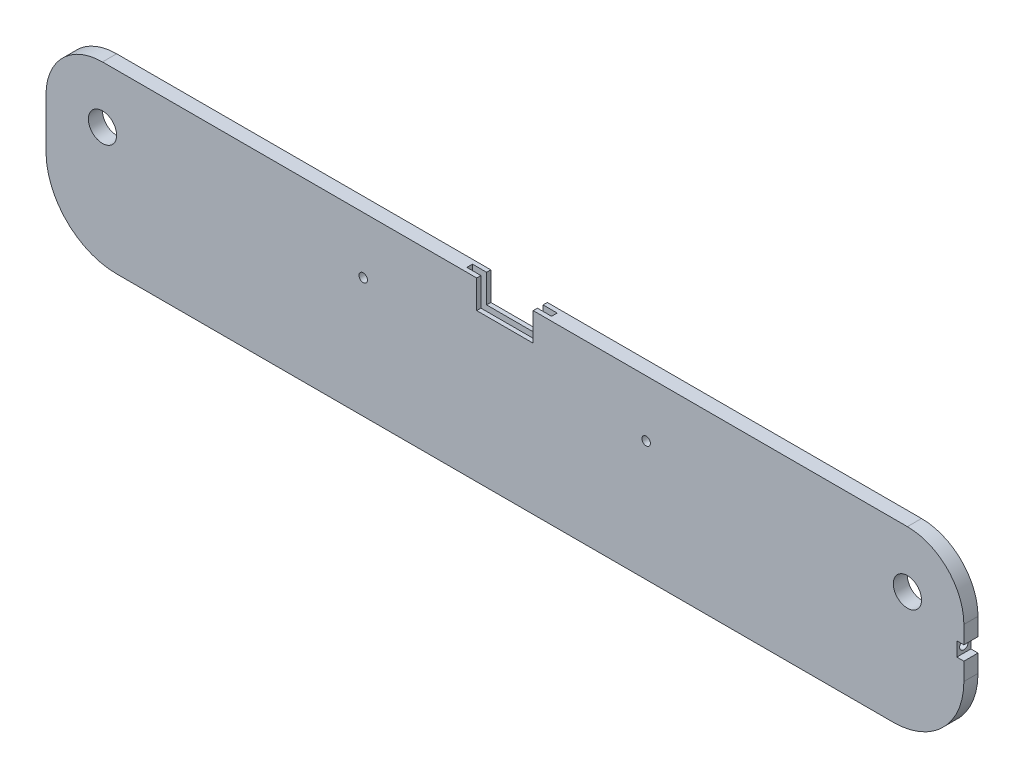
ISO-10303-21;
HEADER;
FILE_DESCRIPTION(('STEP AP214'),'2;1');
FILE_NAME('part.step','',(''),(''),'','','');
FILE_SCHEMA(('AUTOMOTIVE_DESIGN { 1 0 10303 214 1 1 1 1 }'));
ENDSEC;
DATA;
#1=APPLICATION_CONTEXT('core data for automotive mechanical design processes');
#2=APPLICATION_PROTOCOL_DEFINITION('international standard','automotive_design',2000,#1);
#3=PRODUCT_CONTEXT('',#1,'mechanical');
#4=PRODUCT('Part','Part','',(#3));
#5=PRODUCT_RELATED_PRODUCT_CATEGORY('part','',(#4));
#6=PRODUCT_DEFINITION_FORMATION('','',#4);
#7=PRODUCT_DEFINITION_CONTEXT('part definition',#1,'design');
#8=PRODUCT_DEFINITION('design','',#6,#7);
#9=PRODUCT_DEFINITION_SHAPE('','',#8);
#10=(LENGTH_UNIT() NAMED_UNIT(*) SI_UNIT(.MILLI.,.METRE.));
#11=(NAMED_UNIT(*) PLANE_ANGLE_UNIT() SI_UNIT($,.RADIAN.));
#12=(NAMED_UNIT(*) SI_UNIT($,.STERADIAN.) SOLID_ANGLE_UNIT());
#13=UNCERTAINTY_MEASURE_WITH_UNIT(LENGTH_MEASURE(1.E-05),#10,'distance_accuracy_value','');
#14=(GEOMETRIC_REPRESENTATION_CONTEXT(3) GLOBAL_UNCERTAINTY_ASSIGNED_CONTEXT((#13)) GLOBAL_UNIT_ASSIGNED_CONTEXT((#10,
#11,#12)) REPRESENTATION_CONTEXT('',''));
#15=CARTESIAN_POINT('',(0.,0.,0.));
#16=DIRECTION('',(0.,0.,1.));
#17=DIRECTION('',(1.,0.,0.));
#18=AXIS2_PLACEMENT_3D('',#15,#16,#17);
#19=CARTESIAN_POINT('',(602.895928309746,88.3096819482084,10.));
#20=DIRECTION('',(-1.,0.,0.));
#21=DIRECTION('',(0.,0.,1.));
#22=AXIS2_PLACEMENT_3D('',#19,#20,#21);
#23=PLANE('',#22);
#24=DIRECTION('',(0.,1.,0.));
#25=VECTOR('',#24,1.);
#26=CARTESIAN_POINT('',(602.895928309746,88.3096819482084,0.));
#27=LINE('',#26,#25);
#28=CARTESIAN_POINT('',(602.895928309746,35.8096819482084,0.));
#29=VERTEX_POINT('',#28);
#30=CARTESIAN_POINT('',(602.895928309746,48.3096819482084,0.));
#31=VERTEX_POINT('',#30);
#32=EDGE_CURVE('E344',#29,#31,#27,.T.);
#33=ORIENTED_EDGE('',*,*,#32,.T.);
#34=DIRECTION('',(0.,0.,-1.));
#35=VECTOR('',#34,1.);
#36=CARTESIAN_POINT('',(602.895928309746,48.3096819482084,10.));
#37=LINE('',#36,#35);
#38=CARTESIAN_POINT('',(602.895928309746,48.3096819482084,10.));
#39=VERTEX_POINT('',#38);
#40=EDGE_CURVE('E377',#31,#39,#37,.F.);
#41=ORIENTED_EDGE('',*,*,#40,.T.);
#42=DIRECTION('',(0.,1.,0.));
#43=VECTOR('',#42,1.);
#44=CARTESIAN_POINT('',(602.895928309746,88.3096819482084,10.));
#45=LINE('',#44,#43);
#46=CARTESIAN_POINT('',(602.895928309746,35.8096819482084,10.));
#47=VERTEX_POINT('',#46);
#48=EDGE_CURVE('E335',#47,#39,#45,.T.);
#49=ORIENTED_EDGE('',*,*,#48,.F.);
#50=DIRECTION('',(0.,0.,1.));
#51=VECTOR('',#50,1.);
#52=CARTESIAN_POINT('',(602.895928309746,35.8096819482084,10.));
#53=LINE('',#52,#51);
#54=EDGE_CURVE('E221',#29,#47,#53,.T.);
#55=ORIENTED_EDGE('',*,*,#54,.F.);
#56=EDGE_LOOP('',(#33,#41,#49,#55));
#57=FACE_BOUND('',#56,.T.);
#58=ADVANCED_FACE('F39',(#57),#23,.F.);
#59=CARTESIAN_POINT('',(-47.104071690254,88.3096819482084,10.));
#60=DIRECTION('',(0.,-1.,0.));
#61=DIRECTION('',(0.,0.,-1.));
#62=AXIS2_PLACEMENT_3D('',#59,#60,#61);
#63=PLANE('',#62);
#64=DIRECTION('',(-1.,0.,0.));
#65=VECTOR('',#64,1.);
#66=CARTESIAN_POINT('',(-47.104071690254,88.3096819482084,0.));
#67=LINE('',#66,#65);
#68=CARTESIAN_POINT('',(257.895928309746,88.3096819482084,0.));
#69=VERTEX_POINT('',#68);
#70=CARTESIAN_POINT('',(-7.10407169025395,88.3096819482084,0.));
#71=VERTEX_POINT('',#70);
#72=EDGE_CURVE('E347',#69,#71,#67,.T.);
#73=ORIENTED_EDGE('',*,*,#72,.T.);
#74=DIRECTION('',(0.,0.,-1.));
#75=VECTOR('',#74,1.);
#76=CARTESIAN_POINT('',(-7.10407169025395,88.3096819482084,10.));
#77=LINE('',#76,#75);
#78=CARTESIAN_POINT('',(-7.10407169025395,88.3096819482084,10.));
#79=VERTEX_POINT('',#78);
#80=EDGE_CURVE('E47',#71,#79,#77,.F.);
#81=ORIENTED_EDGE('',*,*,#80,.T.);
#82=DIRECTION('',(-1.,0.,0.));
#83=VECTOR('',#82,1.);
#84=CARTESIAN_POINT('',(-47.104071690254,88.3096819482084,10.));
#85=LINE('',#84,#83);
#86=CARTESIAN_POINT('',(257.895928309746,88.3096819482084,10.));
#87=VERTEX_POINT('',#86);
#88=EDGE_CURVE('E337',#87,#79,#85,.T.);
#89=ORIENTED_EDGE('',*,*,#88,.F.);
#90=DIRECTION('',(0.,0.,1.));
#91=VECTOR('',#90,1.);
#92=CARTESIAN_POINT('',(257.895928309746,88.3096819482084,-20.));
#93=LINE('',#92,#91);
#94=CARTESIAN_POINT('',(257.895928309746,88.3096819482084,7.));
#95=VERTEX_POINT('',#94);
#96=EDGE_CURVE('E248',#95,#87,#93,.T.);
#97=ORIENTED_EDGE('',*,*,#96,.F.);
#98=DIRECTION('',(1.,0.,0.));
#99=VECTOR('',#98,1.);
#100=CARTESIAN_POINT('',(307.895928309746,88.3096819482084,7.));
#101=LINE('',#100,#99);
#102=CARTESIAN_POINT('',(247.895928309746,88.3096819482084,7.));
#103=VERTEX_POINT('',#102);
#104=EDGE_CURVE('E291',#103,#95,#101,.T.);
#105=ORIENTED_EDGE('',*,*,#104,.F.);
#106=DIRECTION('',(0.,0.,1.));
#107=VECTOR('',#106,1.);
#108=CARTESIAN_POINT('',(247.895928309746,88.3096819482084,7.));
#109=LINE('',#108,#107);
#110=CARTESIAN_POINT('',(247.895928309746,88.3096819482084,3.));
#111=VERTEX_POINT('',#110);
#112=EDGE_CURVE('E274',#111,#103,#109,.T.);
#113=ORIENTED_EDGE('',*,*,#112,.F.);
#114=DIRECTION('',(-1.,0.,0.));
#115=VECTOR('',#114,1.);
#116=CARTESIAN_POINT('',(277.895928309746,88.3096819482084,3.));
#117=LINE('',#116,#115);
#118=CARTESIAN_POINT('',(257.895928309746,88.3096819482084,3.));
#119=VERTEX_POINT('',#118);
#120=EDGE_CURVE('E297',#119,#111,#117,.T.);
#121=ORIENTED_EDGE('',*,*,#120,.F.);
#122=EDGE_CURVE('E247',#69,#119,#93,.T.);
#123=ORIENTED_EDGE('',*,*,#122,.F.);
#124=EDGE_LOOP('',(#73,#81,#89,#97,#105,#113,#121,#123));
#125=FACE_BOUND('',#124,.T.);
#126=ADVANCED_FACE('F419',(#125),#63,.F.);
#127=CARTESIAN_POINT('',(-47.104071690254,88.3096819482084,10.));
#128=DIRECTION('',(1.,0.,0.));
#129=DIRECTION('',(0.,1.,0.));
#130=AXIS2_PLACEMENT_3D('',#127,#128,#129);
#131=PLANE('',#130);
#132=DIRECTION('',(0.,-1.,0.));
#133=VECTOR('',#132,1.);
#134=CARTESIAN_POINT('',(-47.104071690254,88.3096819482084,10.));
#135=LINE('',#134,#133);
#136=CARTESIAN_POINT('',(-47.1040716902539,48.3096819482084,10.));
#137=VERTEX_POINT('',#136);
#138=CARTESIAN_POINT('',(-47.1040716902539,13.3096819482084,10.));
#139=VERTEX_POINT('',#138);
#140=EDGE_CURVE('E330',#137,#139,#135,.T.);
#141=ORIENTED_EDGE('',*,*,#140,.F.);
#142=DIRECTION('',(0.,0.,-1.));
#143=VECTOR('',#142,1.);
#144=CARTESIAN_POINT('',(-47.1040716902539,48.3096819482084,10.));
#145=LINE('',#144,#143);
#146=CARTESIAN_POINT('',(-47.1040716902539,48.3096819482084,0.));
#147=VERTEX_POINT('',#146);
#148=EDGE_CURVE('E393',#137,#147,#145,.T.);
#149=ORIENTED_EDGE('',*,*,#148,.T.);
#150=DIRECTION('',(0.,-1.,0.));
#151=VECTOR('',#150,1.);
#152=CARTESIAN_POINT('',(-47.104071690254,88.3096819482084,0.));
#153=LINE('',#152,#151);
#154=CARTESIAN_POINT('',(-47.1040716902539,13.3096819482084,0.));
#155=VERTEX_POINT('',#154);
#156=EDGE_CURVE('E327',#147,#155,#153,.T.);
#157=ORIENTED_EDGE('',*,*,#156,.T.);
#158=DIRECTION('',(0.,0.,-1.));
#159=VECTOR('',#158,1.);
#160=CARTESIAN_POINT('',(-47.1040716902539,13.3096819482084,10.));
#161=LINE('',#160,#159);
#162=EDGE_CURVE('E387',#155,#139,#161,.F.);
#163=ORIENTED_EDGE('',*,*,#162,.T.);
#164=EDGE_LOOP('',(#141,#149,#157,#163));
#165=FACE_BOUND('',#164,.T.);
#166=ADVANCED_FACE('F399',(#165),#131,.F.);
#167=CARTESIAN_POINT('',(-47.1040716902539,-36.6903180517916,10.));
#168=DIRECTION('',(0.,1.,0.));
#169=DIRECTION('',(0.,0.,1.));
#170=AXIS2_PLACEMENT_3D('',#167,#168,#169);
#171=PLANE('',#170);
#172=DIRECTION('',(0.,0.,-1.));
#173=VECTOR('',#172,1.);
#174=CARTESIAN_POINT('',(552.895928309746,-36.6903180517916,10.));
#175=LINE('',#174,#173);
#176=CARTESIAN_POINT('',(552.895928309746,-36.6903180517916,0.));
#177=VERTEX_POINT('',#176);
#178=CARTESIAN_POINT('',(552.895928309746,-36.6903180517916,10.));
#179=VERTEX_POINT('',#178);
#180=EDGE_CURVE('E367',#177,#179,#175,.F.);
#181=ORIENTED_EDGE('',*,*,#180,.T.);
#182=DIRECTION('',(1.,0.,0.));
#183=VECTOR('',#182,1.);
#184=CARTESIAN_POINT('',(-47.1040716902539,-36.6903180517916,10.));
#185=LINE('',#184,#183);
#186=CARTESIAN_POINT('',(2.89592830974606,-36.6903180517916,10.));
#187=VERTEX_POINT('',#186);
#188=EDGE_CURVE('E332',#187,#179,#185,.T.);
#189=ORIENTED_EDGE('',*,*,#188,.F.);
#190=DIRECTION('',(0.,0.,-1.));
#191=VECTOR('',#190,1.);
#192=CARTESIAN_POINT('',(2.89592830974606,-36.6903180517916,10.));
#193=LINE('',#192,#191);
#194=CARTESIAN_POINT('',(2.89592830974606,-36.6903180517916,0.));
#195=VERTEX_POINT('',#194);
#196=EDGE_CURVE('E381',#187,#195,#193,.T.);
#197=ORIENTED_EDGE('',*,*,#196,.T.);
#198=DIRECTION('',(1.,0.,0.));
#199=VECTOR('',#198,1.);
#200=CARTESIAN_POINT('',(-47.1040716902539,-36.6903180517916,0.));
#201=LINE('',#200,#199);
#202=EDGE_CURVE('E342',#195,#177,#201,.T.);
#203=ORIENTED_EDGE('',*,*,#202,.T.);
#204=EDGE_LOOP('',(#181,#189,#197,#203));
#205=FACE_BOUND('',#204,.T.);
#206=ADVANCED_FACE('F433',(#205),#171,.F.);
#207=CARTESIAN_POINT('',(602.895928309746,13.3096819482084,10.));
#208=VERTEX_POINT('',#207);
#209=CARTESIAN_POINT('',(602.895928309746,25.8096819482084,10.));
#210=VERTEX_POINT('',#209);
#211=EDGE_CURVE('E226',#208,#210,#45,.T.);
#212=ORIENTED_EDGE('',*,*,#211,.F.);
#213=DIRECTION('',(0.,0.,-1.));
#214=VECTOR('',#213,1.);
#215=CARTESIAN_POINT('',(602.895928309746,13.3096819482084,10.));
#216=LINE('',#215,#214);
#217=CARTESIAN_POINT('',(602.895928309746,13.3096819482084,0.));
#218=VERTEX_POINT('',#217);
#219=EDGE_CURVE('E361',#208,#218,#216,.T.);
#220=ORIENTED_EDGE('',*,*,#219,.T.);
#221=CARTESIAN_POINT('',(602.895928309746,25.8096819482084,0.));
#222=VERTEX_POINT('',#221);
#223=EDGE_CURVE('E345',#218,#222,#27,.T.);
#224=ORIENTED_EDGE('',*,*,#223,.T.);
#225=DIRECTION('',(0.,0.,-1.));
#226=VECTOR('',#225,1.);
#227=CARTESIAN_POINT('',(602.895928309746,25.8096819482084,10.));
#228=LINE('',#227,#226);
#229=EDGE_CURVE('E442',#210,#222,#228,.T.);
#230=ORIENTED_EDGE('',*,*,#229,.F.);
#231=EDGE_LOOP('',(#212,#220,#224,#230));
#232=FACE_BOUND('',#231,.T.);
#233=ADVANCED_FACE('F422',(#232),#23,.F.);
#234=CARTESIAN_POINT('',(562.895928309746,88.3096819482084,10.));
#235=VERTEX_POINT('',#234);
#236=CARTESIAN_POINT('',(297.895928309746,88.3096819482084,10.));
#237=VERTEX_POINT('',#236);
#238=EDGE_CURVE('E338',#235,#237,#85,.T.);
#239=ORIENTED_EDGE('',*,*,#238,.F.);
#240=DIRECTION('',(0.,0.,-1.));
#241=VECTOR('',#240,1.);
#242=CARTESIAN_POINT('',(562.895928309746,88.3096819482084,10.));
#243=LINE('',#242,#241);
#244=CARTESIAN_POINT('',(562.895928309746,88.3096819482084,0.));
#245=VERTEX_POINT('',#244);
#246=EDGE_CURVE('E372',#235,#245,#243,.T.);
#247=ORIENTED_EDGE('',*,*,#246,.T.);
#248=CARTESIAN_POINT('',(297.895928309746,88.3096819482084,0.));
#249=VERTEX_POINT('',#248);
#250=EDGE_CURVE('E333',#245,#249,#67,.T.);
#251=ORIENTED_EDGE('',*,*,#250,.T.);
#252=DIRECTION('',(0.,0.,1.));
#253=VECTOR('',#252,1.);
#254=CARTESIAN_POINT('',(297.895928309746,88.3096819482084,-20.));
#255=LINE('',#254,#253);
#256=CARTESIAN_POINT('',(297.895928309746,88.3096819482084,3.));
#257=VERTEX_POINT('',#256);
#258=EDGE_CURVE('E250',#249,#257,#255,.T.);
#259=ORIENTED_EDGE('',*,*,#258,.T.);
#260=CARTESIAN_POINT('',(307.895928309746,88.3096819482084,3.));
#261=VERTEX_POINT('',#260);
#262=EDGE_CURVE('E279',#261,#257,#117,.T.);
#263=ORIENTED_EDGE('',*,*,#262,.F.);
#264=DIRECTION('',(0.,0.,-1.));
#265=VECTOR('',#264,1.);
#266=CARTESIAN_POINT('',(307.895928309746,88.3096819482084,3.));
#267=LINE('',#266,#265);
#268=CARTESIAN_POINT('',(307.895928309746,88.3096819482084,7.));
#269=VERTEX_POINT('',#268);
#270=EDGE_CURVE('E294',#269,#261,#267,.T.);
#271=ORIENTED_EDGE('',*,*,#270,.F.);
#272=CARTESIAN_POINT('',(297.895928309746,88.3096819482084,7.));
#273=VERTEX_POINT('',#272);
#274=EDGE_CURVE('E290',#273,#269,#101,.T.);
#275=ORIENTED_EDGE('',*,*,#274,.F.);
#276=EDGE_CURVE('E251',#273,#237,#255,.T.);
#277=ORIENTED_EDGE('',*,*,#276,.T.);
#278=EDGE_LOOP('',(#239,#247,#251,#259,#263,#271,#275,#277));
#279=FACE_BOUND('',#278,.T.);
#280=ADVANCED_FACE('F429',(#279),#63,.F.);
#281=CARTESIAN_POINT('',(0.,0.,10.));
#282=DIRECTION('',(0.,0.,1.));
#283=DIRECTION('',(1.,0.,0.));
#284=AXIS2_PLACEMENT_3D('',#281,#282,#283);
#285=PLANE('',#284);
#286=ORIENTED_EDGE('',*,*,#188,.T.);
#287=CARTESIAN_POINT('',(552.895928309746,13.3096819482084,10.));
#288=DIRECTION('',(0.,0.,1.));
#289=DIRECTION('',(1.,0.,0.));
#290=AXIS2_PLACEMENT_3D('',#287,#288,#289);
#291=CIRCLE('',#290,50.);
#292=EDGE_CURVE('E370',#179,#208,#291,.T.);
#293=ORIENTED_EDGE('',*,*,#292,.T.);
#294=ORIENTED_EDGE('',*,*,#211,.T.);
#295=DIRECTION('',(1.,0.,0.));
#296=VECTOR('',#295,1.);
#297=CARTESIAN_POINT('',(597.895928309746,25.8096819482084,10.));
#298=LINE('',#297,#296);
#299=CARTESIAN_POINT('',(597.895928309746,25.8096819482084,10.));
#300=VERTEX_POINT('',#299);
#301=EDGE_CURVE('E205',#300,#210,#298,.T.);
#302=ORIENTED_EDGE('',*,*,#301,.F.);
#303=DIRECTION('',(0.,-1.,0.));
#304=VECTOR('',#303,1.);
#305=CARTESIAN_POINT('',(597.895928309746,25.8096819482084,10.));
#306=LINE('',#305,#304);
#307=CARTESIAN_POINT('',(597.895928309746,35.8096819482084,10.));
#308=VERTEX_POINT('',#307);
#309=EDGE_CURVE('E212',#308,#300,#306,.T.);
#310=ORIENTED_EDGE('',*,*,#309,.F.);
#311=DIRECTION('',(1.,0.,0.));
#312=VECTOR('',#311,1.);
#313=CARTESIAN_POINT('',(597.895928309746,35.8096819482084,10.));
#314=LINE('',#313,#312);
#315=EDGE_CURVE('E237',#308,#47,#314,.T.);
#316=ORIENTED_EDGE('',*,*,#315,.T.);
#317=ORIENTED_EDGE('',*,*,#48,.T.);
#318=CARTESIAN_POINT('',(562.895928309746,48.3096819482084,10.));
#319=DIRECTION('',(0.,0.,1.));
#320=DIRECTION('',(1.,0.,0.));
#321=AXIS2_PLACEMENT_3D('',#318,#319,#320);
#322=CIRCLE('',#321,40.);
#323=EDGE_CURVE('E379',#39,#235,#322,.T.);
#324=ORIENTED_EDGE('',*,*,#323,.T.);
#325=ORIENTED_EDGE('',*,*,#238,.T.);
#326=DIRECTION('',(0.,1.,0.));
#327=VECTOR('',#326,1.);
#328=CARTESIAN_POINT('',(297.895928309746,88.3096819482084,10.));
#329=LINE('',#328,#327);
#330=CARTESIAN_POINT('',(297.895928309746,68.3096819482085,10.));
#331=VERTEX_POINT('',#330);
#332=EDGE_CURVE('E233',#331,#237,#329,.T.);
#333=ORIENTED_EDGE('',*,*,#332,.F.);
#334=DIRECTION('',(1.,0.,0.));
#335=VECTOR('',#334,1.);
#336=CARTESIAN_POINT('',(277.895928309746,68.3096819482085,10.));
#337=LINE('',#336,#335);
#338=CARTESIAN_POINT('',(257.895928309746,68.3096819482084,10.));
#339=VERTEX_POINT('',#338);
#340=EDGE_CURVE('E240',#339,#331,#337,.T.);
#341=ORIENTED_EDGE('',*,*,#340,.F.);
#342=DIRECTION('',(0.,-1.,0.));
#343=VECTOR('',#342,1.);
#344=CARTESIAN_POINT('',(257.895928309746,68.3096819482084,10.));
#345=LINE('',#344,#343);
#346=EDGE_CURVE('E236',#87,#339,#345,.T.);
#347=ORIENTED_EDGE('',*,*,#346,.F.);
#348=ORIENTED_EDGE('',*,*,#88,.T.);
#349=CARTESIAN_POINT('',(-7.10407169025395,48.3096819482084,10.));
#350=DIRECTION('',(0.,0.,1.));
#351=DIRECTION('',(1.,0.,0.));
#352=AXIS2_PLACEMENT_3D('',#349,#350,#351);
#353=CIRCLE('',#352,40.);
#354=EDGE_CURVE('E11',#79,#137,#353,.T.);
#355=ORIENTED_EDGE('',*,*,#354,.T.);
#356=ORIENTED_EDGE('',*,*,#140,.T.);
#357=CARTESIAN_POINT('',(2.89592830974606,13.3096819482084,10.));
#358=DIRECTION('',(0.,0.,1.));
#359=DIRECTION('',(1.,0.,0.));
#360=AXIS2_PLACEMENT_3D('',#357,#358,#359);
#361=CIRCLE('',#360,50.);
#362=EDGE_CURVE('E390',#139,#187,#361,.T.);
#363=ORIENTED_EDGE('',*,*,#362,.T.);
#364=EDGE_LOOP('',(#286,#293,#294,#302,#310,#316,#317,#324,#325,#333,#341,#347,#348,#355,#356,#363));
#365=FACE_BOUND('',#364,.T.);
#366=CARTESIAN_POINT('',(177.509070800599,48.3096819482085,10.));
#367=DIRECTION('',(0.,0.,1.));
#368=DIRECTION('',(1.,0.,0.));
#369=AXIS2_PLACEMENT_3D('',#366,#367,#368);
#370=CIRCLE('',#369,2.99999999999999);
#371=CARTESIAN_POINT('',(180.509070800599,48.3096819482085,10.));
#372=VERTEX_POINT('',#371);
#373=EDGE_CURVE('E310',#372,#372,#370,.T.);
#374=ORIENTED_EDGE('',*,*,#373,.F.);
#375=EDGE_LOOP('',(#374));
#376=FACE_BOUND('',#375,.T.);
#377=CARTESIAN_POINT('',(377.895928309746,48.3096819482086,10.));
#378=DIRECTION('',(0.,0.,1.));
#379=DIRECTION('',(1.,0.,0.));
#380=AXIS2_PLACEMENT_3D('',#377,#378,#379);
#381=CIRCLE('',#380,2.99999999999999);
#382=CARTESIAN_POINT('',(380.895928309746,48.3096819482086,10.));
#383=VERTEX_POINT('',#382);
#384=EDGE_CURVE('E302',#383,#383,#381,.T.);
#385=ORIENTED_EDGE('',*,*,#384,.F.);
#386=EDGE_LOOP('',(#385));
#387=FACE_BOUND('',#386,.T.);
#388=CARTESIAN_POINT('',(562.895928309746,48.3096819482086,10.));
#389=DIRECTION('',(0.,0.,1.));
#390=DIRECTION('',(-1.,0.,0.));
#391=AXIS2_PLACEMENT_3D('',#388,#389,#390);
#392=CIRCLE('',#391,9.99999999999998);
#393=CARTESIAN_POINT('',(552.895928309746,48.3096819482086,10.));
#394=VERTEX_POINT('',#393);
#395=EDGE_CURVE('E320',#394,#394,#392,.T.);
#396=ORIENTED_EDGE('',*,*,#395,.F.);
#397=EDGE_LOOP('',(#396));
#398=FACE_BOUND('',#397,.T.);
#399=CARTESIAN_POINT('',(-7.10407169025393,48.3096819482084,10.));
#400=DIRECTION('',(0.,0.,1.));
#401=DIRECTION('',(1.,0.,0.));
#402=AXIS2_PLACEMENT_3D('',#399,#400,#401);
#403=CIRCLE('',#402,10.);
#404=CARTESIAN_POINT('',(2.89592830974607,48.3096819482084,10.));
#405=VERTEX_POINT('',#404);
#406=EDGE_CURVE('E319',#405,#405,#403,.T.);
#407=ORIENTED_EDGE('',*,*,#406,.F.);
#408=EDGE_LOOP('',(#407));
#409=FACE_BOUND('',#408,.T.);
#410=ADVANCED_FACE('F223',(#365,#376,#387,#398,#409),#285,.T.);
#411=CARTESIAN_POINT('',(0.,0.,0.));
#412=DIRECTION('',(0.,0.,1.));
#413=DIRECTION('',(1.,0.,0.));
#414=AXIS2_PLACEMENT_3D('',#411,#412,#413);
#415=PLANE('',#414);
#416=ORIENTED_EDGE('',*,*,#156,.F.);
#417=CARTESIAN_POINT('',(-7.10407169025395,48.3096819482084,0.));
#418=DIRECTION('',(0.,0.,1.));
#419=DIRECTION('',(1.,0.,0.));
#420=AXIS2_PLACEMENT_3D('',#417,#418,#419);
#421=CIRCLE('',#420,40.);
#422=EDGE_CURVE('E61',#147,#71,#421,.F.);
#423=ORIENTED_EDGE('',*,*,#422,.T.);
#424=ORIENTED_EDGE('',*,*,#72,.F.);
#425=DIRECTION('',(0.,-1.,0.));
#426=VECTOR('',#425,1.);
#427=CARTESIAN_POINT('',(257.895928309746,0.,0.));
#428=LINE('',#427,#426);
#429=CARTESIAN_POINT('',(257.895928309746,68.3096819482084,0.));
#430=VERTEX_POINT('',#429);
#431=EDGE_CURVE('E265',#69,#430,#428,.T.);
#432=ORIENTED_EDGE('',*,*,#431,.T.);
#433=DIRECTION('',(1.,0.,0.));
#434=VECTOR('',#433,1.);
#435=CARTESIAN_POINT('',(-3.79194908518604E-13,68.309681948207,0.));
#436=LINE('',#435,#434);
#437=CARTESIAN_POINT('',(297.895928309746,68.3096819482085,0.));
#438=VERTEX_POINT('',#437);
#439=EDGE_CURVE('E271',#430,#438,#436,.T.);
#440=ORIENTED_EDGE('',*,*,#439,.T.);
#441=DIRECTION('',(0.,1.,0.));
#442=VECTOR('',#441,1.);
#443=CARTESIAN_POINT('',(297.895928309746,0.,0.));
#444=LINE('',#443,#442);
#445=EDGE_CURVE('E259',#438,#249,#444,.T.);
#446=ORIENTED_EDGE('',*,*,#445,.T.);
#447=ORIENTED_EDGE('',*,*,#250,.F.);
#448=CARTESIAN_POINT('',(562.895928309746,48.3096819482084,0.));
#449=DIRECTION('',(0.,0.,1.));
#450=DIRECTION('',(1.,0.,0.));
#451=AXIS2_PLACEMENT_3D('',#448,#449,#450);
#452=CIRCLE('',#451,40.);
#453=EDGE_CURVE('E375',#245,#31,#452,.F.);
#454=ORIENTED_EDGE('',*,*,#453,.T.);
#455=ORIENTED_EDGE('',*,*,#32,.F.);
#456=DIRECTION('',(1.,0.,0.));
#457=VECTOR('',#456,1.);
#458=CARTESIAN_POINT('',(597.895928309746,35.8096819482084,0.));
#459=LINE('',#458,#457);
#460=CARTESIAN_POINT('',(597.895928309746,35.8096819482084,0.));
#461=VERTEX_POINT('',#460);
#462=EDGE_CURVE('E228',#461,#29,#459,.T.);
#463=ORIENTED_EDGE('',*,*,#462,.F.);
#464=DIRECTION('',(0.,1.,0.));
#465=VECTOR('',#464,1.);
#466=CARTESIAN_POINT('',(597.895928309746,25.8096819482084,0.));
#467=LINE('',#466,#465);
#468=CARTESIAN_POINT('',(597.895928309746,25.8096819482084,0.));
#469=VERTEX_POINT('',#468);
#470=EDGE_CURVE('E211',#469,#461,#467,.T.);
#471=ORIENTED_EDGE('',*,*,#470,.F.);
#472=DIRECTION('',(1.,0.,0.));
#473=VECTOR('',#472,1.);
#474=CARTESIAN_POINT('',(597.895928309746,25.8096819482084,0.));
#475=LINE('',#474,#473);
#476=EDGE_CURVE('E208',#469,#222,#475,.T.);
#477=ORIENTED_EDGE('',*,*,#476,.T.);
#478=ORIENTED_EDGE('',*,*,#223,.F.);
#479=CARTESIAN_POINT('',(552.895928309746,13.3096819482084,0.));
#480=DIRECTION('',(0.,0.,1.));
#481=DIRECTION('',(1.,0.,0.));
#482=AXIS2_PLACEMENT_3D('',#479,#480,#481);
#483=CIRCLE('',#482,50.);
#484=EDGE_CURVE('E364',#218,#177,#483,.F.);
#485=ORIENTED_EDGE('',*,*,#484,.T.);
#486=ORIENTED_EDGE('',*,*,#202,.F.);
#487=CARTESIAN_POINT('',(2.89592830974606,13.3096819482084,0.));
#488=DIRECTION('',(0.,0.,1.));
#489=DIRECTION('',(1.,0.,0.));
#490=AXIS2_PLACEMENT_3D('',#487,#488,#489);
#491=CIRCLE('',#490,50.);
#492=EDGE_CURVE('E384',#195,#155,#491,.F.);
#493=ORIENTED_EDGE('',*,*,#492,.T.);
#494=EDGE_LOOP('',(#416,#423,#424,#432,#440,#446,#447,#454,#455,#463,#471,#477,#478,#485,#486,#493));
#495=FACE_BOUND('',#494,.T.);
#496=CARTESIAN_POINT('',(177.509070800599,48.3096819482085,0.));
#497=DIRECTION('',(0.,0.,1.));
#498=DIRECTION('',(1.,0.,0.));
#499=AXIS2_PLACEMENT_3D('',#496,#497,#498);
#500=CIRCLE('',#499,2.99999999999999);
#501=CARTESIAN_POINT('',(180.509070800599,48.3096819482085,0.));
#502=VERTEX_POINT('',#501);
#503=EDGE_CURVE('E323',#502,#502,#500,.T.);
#504=ORIENTED_EDGE('',*,*,#503,.T.);
#505=EDGE_LOOP('',(#504));
#506=FACE_BOUND('',#505,.T.);
#507=CARTESIAN_POINT('',(377.895928309746,48.3096819482086,0.));
#508=DIRECTION('',(0.,0.,1.));
#509=DIRECTION('',(1.,0.,0.));
#510=AXIS2_PLACEMENT_3D('',#507,#508,#509);
#511=CIRCLE('',#510,2.99999999999999);
#512=CARTESIAN_POINT('',(380.895928309746,48.3096819482086,0.));
#513=VERTEX_POINT('',#512);
#514=EDGE_CURVE('E313',#513,#513,#511,.T.);
#515=ORIENTED_EDGE('',*,*,#514,.T.);
#516=EDGE_LOOP('',(#515));
#517=FACE_BOUND('',#516,.T.);
#518=CARTESIAN_POINT('',(562.895928309746,48.3096819482086,0.));
#519=DIRECTION('',(0.,0.,1.));
#520=DIRECTION('',(-1.,0.,0.));
#521=AXIS2_PLACEMENT_3D('',#518,#519,#520);
#522=CIRCLE('',#521,9.99999999999998);
#523=CARTESIAN_POINT('',(552.895928309746,48.3096819482086,0.));
#524=VERTEX_POINT('',#523);
#525=EDGE_CURVE('E316',#524,#524,#522,.T.);
#526=ORIENTED_EDGE('',*,*,#525,.T.);
#527=EDGE_LOOP('',(#526));
#528=FACE_BOUND('',#527,.T.);
#529=CARTESIAN_POINT('',(-7.10407169025393,48.3096819482084,0.));
#530=DIRECTION('',(0.,0.,1.));
#531=DIRECTION('',(1.,0.,0.));
#532=AXIS2_PLACEMENT_3D('',#529,#530,#531);
#533=CIRCLE('',#532,10.);
#534=CARTESIAN_POINT('',(2.89592830974607,48.3096819482084,0.));
#535=VERTEX_POINT('',#534);
#536=EDGE_CURVE('E324',#535,#535,#533,.T.);
#537=ORIENTED_EDGE('',*,*,#536,.T.);
#538=EDGE_LOOP('',(#537));
#539=FACE_BOUND('',#538,.T.);
#540=ADVANCED_FACE('F402',(#495,#506,#517,#528,#539),#415,.F.);
#541=CARTESIAN_POINT('',(-7.10407169025393,48.3096819482084,0.));
#542=DIRECTION('',(0.,0.,1.));
#543=DIRECTION('',(1.,0.,0.));
#544=AXIS2_PLACEMENT_3D('',#541,#542,#543);
#545=CYLINDRICAL_SURFACE('',#544,10.);
#546=ORIENTED_EDGE('',*,*,#536,.F.);
#547=EDGE_LOOP('',(#546));
#548=FACE_BOUND('',#547,.T.);
#549=ORIENTED_EDGE('',*,*,#406,.T.);
#550=EDGE_LOOP('',(#549));
#551=FACE_BOUND('',#550,.T.);
#552=ADVANCED_FACE('F565',(#548,#551),#545,.F.);
#553=CARTESIAN_POINT('',(562.895928309746,48.3096819482086,0.));
#554=DIRECTION('',(0.,0.,1.));
#555=DIRECTION('',(1.,0.,0.));
#556=AXIS2_PLACEMENT_3D('',#553,#554,#555);
#557=CYLINDRICAL_SURFACE('',#556,9.99999999999998);
#558=ORIENTED_EDGE('',*,*,#525,.F.);
#559=EDGE_LOOP('',(#558));
#560=FACE_BOUND('',#559,.T.);
#561=ORIENTED_EDGE('',*,*,#395,.T.);
#562=EDGE_LOOP('',(#561));
#563=FACE_BOUND('',#562,.T.);
#564=ADVANCED_FACE('F583',(#560,#563),#557,.F.);
#565=CARTESIAN_POINT('',(377.895928309746,48.3096819482086,-10.));
#566=DIRECTION('',(0.,0.,1.));
#567=DIRECTION('',(1.,0.,0.));
#568=AXIS2_PLACEMENT_3D('',#565,#566,#567);
#569=CYLINDRICAL_SURFACE('',#568,2.99999999999999);
#570=ORIENTED_EDGE('',*,*,#384,.T.);
#571=EDGE_LOOP('',(#570));
#572=FACE_BOUND('',#571,.T.);
#573=ORIENTED_EDGE('',*,*,#514,.F.);
#574=EDGE_LOOP('',(#573));
#575=FACE_BOUND('',#574,.T.);
#576=ADVANCED_FACE('F593',(#572,#575),#569,.F.);
#577=CARTESIAN_POINT('',(177.509070800599,48.3096819482085,-10.));
#578=DIRECTION('',(0.,0.,1.));
#579=DIRECTION('',(1.,0.,0.));
#580=AXIS2_PLACEMENT_3D('',#577,#578,#579);
#581=CYLINDRICAL_SURFACE('',#580,2.99999999999999);
#582=ORIENTED_EDGE('',*,*,#373,.T.);
#583=EDGE_LOOP('',(#582));
#584=FACE_BOUND('',#583,.T.);
#585=ORIENTED_EDGE('',*,*,#503,.F.);
#586=EDGE_LOOP('',(#585));
#587=FACE_BOUND('',#586,.T.);
#588=ADVANCED_FACE('F603',(#584,#587),#581,.F.);
#589=CARTESIAN_POINT('',(277.895928309746,58.3096819482084,3.));
#590=DIRECTION('',(0.,0.,-1.));
#591=DIRECTION('',(-1.,0.,0.));
#592=AXIS2_PLACEMENT_3D('',#589,#590,#591);
#593=PLANE('',#592);
#594=DIRECTION('',(-1.,0.,0.));
#595=VECTOR('',#594,1.);
#596=CARTESIAN_POINT('',(277.895928309746,68.3096819482085,3.));
#597=LINE('',#596,#595);
#598=CARTESIAN_POINT('',(297.895928309746,68.3096819482085,3.));
#599=VERTEX_POINT('',#598);
#600=CARTESIAN_POINT('',(257.895928309746,68.3096819482084,3.));
#601=VERTEX_POINT('',#600);
#602=EDGE_CURVE('E268',#599,#601,#597,.T.);
#603=ORIENTED_EDGE('',*,*,#602,.T.);
#604=DIRECTION('',(0.,1.,0.));
#605=VECTOR('',#604,1.);
#606=CARTESIAN_POINT('',(257.895928309746,58.3096819482084,3.));
#607=LINE('',#606,#605);
#608=EDGE_CURVE('E262',#601,#119,#607,.T.);
#609=ORIENTED_EDGE('',*,*,#608,.T.);
#610=ORIENTED_EDGE('',*,*,#120,.T.);
#611=DIRECTION('',(0.,1.,0.));
#612=VECTOR('',#611,1.);
#613=CARTESIAN_POINT('',(247.895928309746,58.3096819482084,3.));
#614=LINE('',#613,#612);
#615=CARTESIAN_POINT('',(247.895928309746,58.3096819482084,3.));
#616=VERTEX_POINT('',#615);
#617=EDGE_CURVE('E287',#616,#111,#614,.T.);
#618=ORIENTED_EDGE('',*,*,#617,.F.);
#619=DIRECTION('',(-1.,0.,0.));
#620=VECTOR('',#619,1.);
#621=CARTESIAN_POINT('',(247.895928309746,58.3096819482084,3.));
#622=LINE('',#621,#620);
#623=CARTESIAN_POINT('',(307.895928309746,58.3096819482084,3.));
#624=VERTEX_POINT('',#623);
#625=EDGE_CURVE('E275',#624,#616,#622,.T.);
#626=ORIENTED_EDGE('',*,*,#625,.F.);
#627=DIRECTION('',(0.,1.,0.));
#628=VECTOR('',#627,1.);
#629=CARTESIAN_POINT('',(307.895928309746,58.3096819482084,3.));
#630=LINE('',#629,#628);
#631=EDGE_CURVE('E300',#624,#261,#630,.T.);
#632=ORIENTED_EDGE('',*,*,#631,.T.);
#633=ORIENTED_EDGE('',*,*,#262,.T.);
#634=DIRECTION('',(0.,-1.,0.));
#635=VECTOR('',#634,1.);
#636=CARTESIAN_POINT('',(297.895928309746,58.3096819482084,3.));
#637=LINE('',#636,#635);
#638=EDGE_CURVE('E256',#257,#599,#637,.T.);
#639=ORIENTED_EDGE('',*,*,#638,.T.);
#640=EDGE_LOOP('',(#603,#609,#610,#618,#626,#632,#633,#639));
#641=FACE_BOUND('',#640,.T.);
#642=ADVANCED_FACE('F493',(#641),#593,.F.);
#643=CARTESIAN_POINT('',(307.895928309746,58.3096819482084,3.));
#644=DIRECTION('',(1.,0.,0.));
#645=DIRECTION('',(0.,0.,-1.));
#646=AXIS2_PLACEMENT_3D('',#643,#644,#645);
#647=PLANE('',#646);
#648=ORIENTED_EDGE('',*,*,#270,.T.);
#649=ORIENTED_EDGE('',*,*,#631,.F.);
#650=DIRECTION('',(0.,0.,-1.));
#651=VECTOR('',#650,1.);
#652=CARTESIAN_POINT('',(307.895928309746,58.3096819482084,3.));
#653=LINE('',#652,#651);
#654=CARTESIAN_POINT('',(307.895928309746,58.3096819482084,7.));
#655=VERTEX_POINT('',#654);
#656=EDGE_CURVE('E284',#655,#624,#653,.T.);
#657=ORIENTED_EDGE('',*,*,#656,.F.);
#658=DIRECTION('',(0.,1.,0.));
#659=VECTOR('',#658,1.);
#660=CARTESIAN_POINT('',(307.895928309746,58.3096819482084,7.));
#661=LINE('',#660,#659);
#662=EDGE_CURVE('E303',#655,#269,#661,.T.);
#663=ORIENTED_EDGE('',*,*,#662,.T.);
#664=EDGE_LOOP('',(#648,#649,#657,#663));
#665=FACE_BOUND('',#664,.T.);
#666=ADVANCED_FACE('F509',(#665),#647,.F.);
#667=CARTESIAN_POINT('',(307.895928309746,58.3096819482084,7.));
#668=DIRECTION('',(0.,0.,1.));
#669=DIRECTION('',(1.,0.,0.));
#670=AXIS2_PLACEMENT_3D('',#667,#668,#669);
#671=PLANE('',#670);
#672=ORIENTED_EDGE('',*,*,#104,.T.);
#673=DIRECTION('',(0.,-1.,0.));
#674=VECTOR('',#673,1.);
#675=CARTESIAN_POINT('',(257.895928309746,58.3096819482084,7.));
#676=LINE('',#675,#674);
#677=CARTESIAN_POINT('',(257.895928309746,68.3096819482084,7.));
#678=VERTEX_POINT('',#677);
#679=EDGE_CURVE('E358',#95,#678,#676,.T.);
#680=ORIENTED_EDGE('',*,*,#679,.T.);
#681=DIRECTION('',(1.,0.,0.));
#682=VECTOR('',#681,1.);
#683=CARTESIAN_POINT('',(307.895928309746,68.3096819482087,7.));
#684=LINE('',#683,#682);
#685=CARTESIAN_POINT('',(297.895928309746,68.3096819482085,7.));
#686=VERTEX_POINT('',#685);
#687=EDGE_CURVE('E355',#678,#686,#684,.T.);
#688=ORIENTED_EDGE('',*,*,#687,.T.);
#689=DIRECTION('',(0.,1.,0.));
#690=VECTOR('',#689,1.);
#691=CARTESIAN_POINT('',(297.895928309746,58.3096819482084,7.));
#692=LINE('',#691,#690);
#693=EDGE_CURVE('E340',#686,#273,#692,.T.);
#694=ORIENTED_EDGE('',*,*,#693,.T.);
#695=ORIENTED_EDGE('',*,*,#274,.T.);
#696=ORIENTED_EDGE('',*,*,#662,.F.);
#697=DIRECTION('',(1.,0.,0.));
#698=VECTOR('',#697,1.);
#699=CARTESIAN_POINT('',(277.895928309746,58.3096819482084,7.));
#700=LINE('',#699,#698);
#701=CARTESIAN_POINT('',(247.895928309746,58.3096819482084,7.));
#702=VERTEX_POINT('',#701);
#703=EDGE_CURVE('E282',#702,#655,#700,.T.);
#704=ORIENTED_EDGE('',*,*,#703,.F.);
#705=DIRECTION('',(0.,1.,0.));
#706=VECTOR('',#705,1.);
#707=CARTESIAN_POINT('',(247.895928309746,58.3096819482084,7.));
#708=LINE('',#707,#706);
#709=EDGE_CURVE('E306',#702,#103,#708,.T.);
#710=ORIENTED_EDGE('',*,*,#709,.T.);
#711=EDGE_LOOP('',(#672,#680,#688,#694,#695,#696,#704,#710));
#712=FACE_BOUND('',#711,.T.);
#713=ADVANCED_FACE('F484',(#712),#671,.F.);
#714=CARTESIAN_POINT('',(247.895928309746,58.3096819482084,7.));
#715=DIRECTION('',(-1.,0.,0.));
#716=DIRECTION('',(0.,0.,1.));
#717=AXIS2_PLACEMENT_3D('',#714,#715,#716);
#718=PLANE('',#717);
#719=ORIENTED_EDGE('',*,*,#112,.T.);
#720=ORIENTED_EDGE('',*,*,#709,.F.);
#721=DIRECTION('',(0.,0.,1.));
#722=VECTOR('',#721,1.);
#723=CARTESIAN_POINT('',(247.895928309746,58.3096819482084,7.));
#724=LINE('',#723,#722);
#725=EDGE_CURVE('E278',#616,#702,#724,.T.);
#726=ORIENTED_EDGE('',*,*,#725,.F.);
#727=ORIENTED_EDGE('',*,*,#617,.T.);
#728=EDGE_LOOP('',(#719,#720,#726,#727));
#729=FACE_BOUND('',#728,.T.);
#730=ADVANCED_FACE('F489',(#729),#718,.F.);
#731=CARTESIAN_POINT('',(0.,58.3096819482084,0.));
#732=DIRECTION('',(0.,-1.,0.));
#733=DIRECTION('',(0.,0.,-1.));
#734=AXIS2_PLACEMENT_3D('',#731,#732,#733);
#735=PLANE('',#734);
#736=ORIENTED_EDGE('',*,*,#625,.T.);
#737=ORIENTED_EDGE('',*,*,#725,.T.);
#738=ORIENTED_EDGE('',*,*,#703,.T.);
#739=ORIENTED_EDGE('',*,*,#656,.T.);
#740=EDGE_LOOP('',(#736,#737,#738,#739));
#741=FACE_BOUND('',#740,.T.);
#742=ADVANCED_FACE('F518',(#741),#735,.F.);
#743=CARTESIAN_POINT('',(297.895928309746,88.3096819482084,-20.));
#744=DIRECTION('',(1.,0.,0.));
#745=DIRECTION('',(0.,0.,-1.));
#746=AXIS2_PLACEMENT_3D('',#743,#744,#745);
#747=PLANE('',#746);
#748=DIRECTION('',(0.,0.,1.));
#749=VECTOR('',#748,1.);
#750=CARTESIAN_POINT('',(297.895928309746,68.3096819482085,-20.));
#751=LINE('',#750,#749);
#752=EDGE_CURVE('E243',#686,#331,#751,.T.);
#753=ORIENTED_EDGE('',*,*,#752,.T.);
#754=ORIENTED_EDGE('',*,*,#332,.T.);
#755=ORIENTED_EDGE('',*,*,#276,.F.);
#756=ORIENTED_EDGE('',*,*,#693,.F.);
#757=EDGE_LOOP('',(#753,#754,#755,#756));
#758=FACE_BOUND('',#757,.T.);
#759=ADVANCED_FACE('F474',(#758),#747,.F.);
#760=CARTESIAN_POINT('',(257.895928309746,68.3096819482084,-20.));
#761=DIRECTION('',(-1.,0.,0.));
#762=DIRECTION('',(0.,0.,1.));
#763=AXIS2_PLACEMENT_3D('',#760,#761,#762);
#764=PLANE('',#763);
#765=ORIENTED_EDGE('',*,*,#96,.T.);
#766=ORIENTED_EDGE('',*,*,#346,.T.);
#767=DIRECTION('',(0.,0.,1.));
#768=VECTOR('',#767,1.);
#769=CARTESIAN_POINT('',(257.895928309746,68.3096819482084,-20.));
#770=LINE('',#769,#768);
#771=EDGE_CURVE('E244',#678,#339,#770,.T.);
#772=ORIENTED_EDGE('',*,*,#771,.F.);
#773=ORIENTED_EDGE('',*,*,#679,.F.);
#774=EDGE_LOOP('',(#765,#766,#772,#773));
#775=FACE_BOUND('',#774,.T.);
#776=ADVANCED_FACE('F510',(#775),#764,.F.);
#777=CARTESIAN_POINT('',(277.895928309746,68.3096819482085,-20.));
#778=DIRECTION('',(0.,-1.,0.));
#779=DIRECTION('',(1.,0.,0.));
#780=AXIS2_PLACEMENT_3D('',#777,#778,#779);
#781=PLANE('',#780);
#782=ORIENTED_EDGE('',*,*,#771,.T.);
#783=ORIENTED_EDGE('',*,*,#340,.T.);
#784=ORIENTED_EDGE('',*,*,#752,.F.);
#785=ORIENTED_EDGE('',*,*,#687,.F.);
#786=EDGE_LOOP('',(#782,#783,#784,#785));
#787=FACE_BOUND('',#786,.T.);
#788=ADVANCED_FACE('F477',(#787),#781,.F.);
#789=EDGE_CURVE('E246',#430,#601,#770,.T.);
#790=ORIENTED_EDGE('',*,*,#789,.T.);
#791=ORIENTED_EDGE('',*,*,#602,.F.);
#792=EDGE_CURVE('E254',#438,#599,#751,.T.);
#793=ORIENTED_EDGE('',*,*,#792,.F.);
#794=ORIENTED_EDGE('',*,*,#439,.F.);
#795=EDGE_LOOP('',(#790,#791,#793,#794));
#796=FACE_BOUND('',#795,.T.);
#797=ADVANCED_FACE('F500',(#796),#781,.F.);
#798=ORIENTED_EDGE('',*,*,#122,.T.);
#799=ORIENTED_EDGE('',*,*,#608,.F.);
#800=ORIENTED_EDGE('',*,*,#789,.F.);
#801=ORIENTED_EDGE('',*,*,#431,.F.);
#802=EDGE_LOOP('',(#798,#799,#800,#801));
#803=FACE_BOUND('',#802,.T.);
#804=ADVANCED_FACE('F498',(#803),#764,.F.);
#805=ORIENTED_EDGE('',*,*,#792,.T.);
#806=ORIENTED_EDGE('',*,*,#638,.F.);
#807=ORIENTED_EDGE('',*,*,#258,.F.);
#808=ORIENTED_EDGE('',*,*,#445,.F.);
#809=EDGE_LOOP('',(#805,#806,#807,#808));
#810=FACE_BOUND('',#809,.T.);
#811=ADVANCED_FACE('F503',(#810),#747,.F.);
#812=CARTESIAN_POINT('',(597.895928309746,35.8096819482084,10.));
#813=DIRECTION('',(0.,1.,0.));
#814=DIRECTION('',(0.,0.,1.));
#815=AXIS2_PLACEMENT_3D('',#812,#813,#814);
#816=PLANE('',#815);
#817=ORIENTED_EDGE('',*,*,#54,.T.);
#818=ORIENTED_EDGE('',*,*,#315,.F.);
#819=DIRECTION('',(0.,0.,1.));
#820=VECTOR('',#819,1.);
#821=CARTESIAN_POINT('',(597.895928309746,35.8096819482084,10.));
#822=LINE('',#821,#820);
#823=EDGE_CURVE('E218',#461,#308,#822,.T.);
#824=ORIENTED_EDGE('',*,*,#823,.F.);
#825=ORIENTED_EDGE('',*,*,#462,.T.);
#826=EDGE_LOOP('',(#817,#818,#824,#825));
#827=FACE_BOUND('',#826,.T.);
#828=ADVANCED_FACE('F458',(#827),#816,.F.);
#829=CARTESIAN_POINT('',(597.895928309746,25.8096819482084,10.));
#830=DIRECTION('',(0.,-1.,0.));
#831=DIRECTION('',(0.,0.,-1.));
#832=AXIS2_PLACEMENT_3D('',#829,#830,#831);
#833=PLANE('',#832);
#834=ORIENTED_EDGE('',*,*,#229,.T.);
#835=ORIENTED_EDGE('',*,*,#476,.F.);
#836=DIRECTION('',(0.,0.,-1.));
#837=VECTOR('',#836,1.);
#838=CARTESIAN_POINT('',(597.895928309746,25.8096819482084,10.));
#839=LINE('',#838,#837);
#840=EDGE_CURVE('E200',#300,#469,#839,.T.);
#841=ORIENTED_EDGE('',*,*,#840,.F.);
#842=ORIENTED_EDGE('',*,*,#301,.T.);
#843=EDGE_LOOP('',(#834,#835,#841,#842));
#844=FACE_BOUND('',#843,.T.);
#845=ADVANCED_FACE('F203',(#844),#833,.F.);
#846=CARTESIAN_POINT('',(597.895928309746,0.,0.));
#847=DIRECTION('',(-1.,0.,0.));
#848=DIRECTION('',(0.,0.,1.));
#849=AXIS2_PLACEMENT_3D('',#846,#847,#848);
#850=PLANE('',#849);
#851=CARTESIAN_POINT('',(597.895928309746,30.8096819482084,5.));
#852=DIRECTION('',(1.,0.,0.));
#853=DIRECTION('',(0.,0.,-1.));
#854=AXIS2_PLACEMENT_3D('',#851,#852,#853);
#855=CIRCLE('',#854,3.);
#856=CARTESIAN_POINT('',(597.895928309746,30.8096819482084,2.));
#857=VERTEX_POINT('',#856);
#858=EDGE_CURVE('E451',#857,#857,#855,.T.);
#859=ORIENTED_EDGE('',*,*,#858,.F.);
#860=EDGE_LOOP('',(#859));
#861=FACE_BOUND('',#860,.T.);
#862=ORIENTED_EDGE('',*,*,#309,.T.);
#863=ORIENTED_EDGE('',*,*,#840,.T.);
#864=ORIENTED_EDGE('',*,*,#470,.T.);
#865=ORIENTED_EDGE('',*,*,#823,.T.);
#866=EDGE_LOOP('',(#862,#863,#864,#865));
#867=FACE_BOUND('',#866,.T.);
#868=ADVANCED_FACE('F216',(#861,#867),#850,.F.);
#869=CARTESIAN_POINT('',(592.895928309746,30.8096819482084,5.));
#870=DIRECTION('',(1.,0.,0.));
#871=DIRECTION('',(0.,0.,-1.));
#872=AXIS2_PLACEMENT_3D('',#869,#870,#871);
#873=CYLINDRICAL_SURFACE('',#872,3.);
#874=CARTESIAN_POINT('',(592.895928309746,30.8096819482084,5.));
#875=DIRECTION('',(1.,0.,0.));
#876=DIRECTION('',(0.,0.,-1.));
#877=AXIS2_PLACEMENT_3D('',#874,#875,#876);
#878=CIRCLE('',#877,3.);
#879=CARTESIAN_POINT('',(592.895928309746,30.8096819482084,2.));
#880=VERTEX_POINT('',#879);
#881=EDGE_CURVE('E447',#880,#880,#878,.T.);
#882=ORIENTED_EDGE('',*,*,#881,.F.);
#883=EDGE_LOOP('',(#882));
#884=FACE_BOUND('',#883,.T.);
#885=ORIENTED_EDGE('',*,*,#858,.T.);
#886=EDGE_LOOP('',(#885));
#887=FACE_BOUND('',#886,.T.);
#888=ADVANCED_FACE('F534',(#884,#887),#873,.F.);
#889=CARTESIAN_POINT('',(592.895928309746,30.8096819482084,5.));
#890=DIRECTION('',(1.,0.,0.));
#891=DIRECTION('',(0.,0.,-1.));
#892=AXIS2_PLACEMENT_3D('',#889,#890,#891);
#893=PLANE('',#892);
#894=ORIENTED_EDGE('',*,*,#881,.T.);
#895=EDGE_LOOP('',(#894));
#896=FACE_BOUND('',#895,.T.);
#897=ADVANCED_FACE('F538',(#896),#893,.T.);
#898=CARTESIAN_POINT('',(552.895928309746,13.3096819482084,10.));
#899=DIRECTION('',(0.,0.,-1.));
#900=DIRECTION('',(-1.,0.,0.));
#901=AXIS2_PLACEMENT_3D('',#898,#899,#900);
#902=CYLINDRICAL_SURFACE('',#901,50.);
#903=ORIENTED_EDGE('',*,*,#292,.F.);
#904=ORIENTED_EDGE('',*,*,#180,.F.);
#905=ORIENTED_EDGE('',*,*,#484,.F.);
#906=ORIENTED_EDGE('',*,*,#219,.F.);
#907=EDGE_LOOP('',(#903,#904,#905,#906));
#908=FACE_BOUND('',#907,.T.);
#909=ADVANCED_FACE('F445',(#908),#902,.T.);
#910=CARTESIAN_POINT('',(562.895928309746,48.3096819482084,10.));
#911=DIRECTION('',(0.,0.,-1.));
#912=DIRECTION('',(-1.,0.,0.));
#913=AXIS2_PLACEMENT_3D('',#910,#911,#912);
#914=CYLINDRICAL_SURFACE('',#913,40.);
#915=ORIENTED_EDGE('',*,*,#323,.F.);
#916=ORIENTED_EDGE('',*,*,#40,.F.);
#917=ORIENTED_EDGE('',*,*,#453,.F.);
#918=ORIENTED_EDGE('',*,*,#246,.F.);
#919=EDGE_LOOP('',(#915,#916,#917,#918));
#920=FACE_BOUND('',#919,.T.);
#921=ADVANCED_FACE('F417',(#920),#914,.T.);
#922=CARTESIAN_POINT('',(2.89592830974606,13.3096819482084,10.));
#923=DIRECTION('',(0.,0.,-1.));
#924=DIRECTION('',(-1.,0.,0.));
#925=AXIS2_PLACEMENT_3D('',#922,#923,#924);
#926=CYLINDRICAL_SURFACE('',#925,50.);
#927=ORIENTED_EDGE('',*,*,#362,.F.);
#928=ORIENTED_EDGE('',*,*,#162,.F.);
#929=ORIENTED_EDGE('',*,*,#492,.F.);
#930=ORIENTED_EDGE('',*,*,#196,.F.);
#931=EDGE_LOOP('',(#927,#928,#929,#930));
#932=FACE_BOUND('',#931,.T.);
#933=ADVANCED_FACE('F409',(#932),#926,.T.);
#934=CARTESIAN_POINT('',(-7.10407169025395,48.3096819482084,10.));
#935=DIRECTION('',(0.,0.,-1.));
#936=DIRECTION('',(-1.,0.,0.));
#937=AXIS2_PLACEMENT_3D('',#934,#935,#936);
#938=CYLINDRICAL_SURFACE('',#937,40.);
#939=ORIENTED_EDGE('',*,*,#354,.F.);
#940=ORIENTED_EDGE('',*,*,#80,.F.);
#941=ORIENTED_EDGE('',*,*,#422,.F.);
#942=ORIENTED_EDGE('',*,*,#148,.F.);
#943=EDGE_LOOP('',(#939,#940,#941,#942));
#944=FACE_BOUND('',#943,.T.);
#945=ADVANCED_FACE('F41',(#944),#938,.T.);
#946=CLOSED_SHELL('',(#58,#126,#166,#206,#233,#280,#410,#540,#552,#564,#576,#588,#642,#666,#713,
#730,#742,#759,#776,#788,#797,#804,#811,#828,#845,#868,#888,#897,#909,#921,#933,#945));
#947=MANIFOLD_SOLID_BREP('B2',#946);
#948=ADVANCED_BREP_SHAPE_REPRESENTATION('',(#18,#947),#14);
#949=SHAPE_DEFINITION_REPRESENTATION(#9,#948);
ENDSEC;
END-ISO-10303-21;
